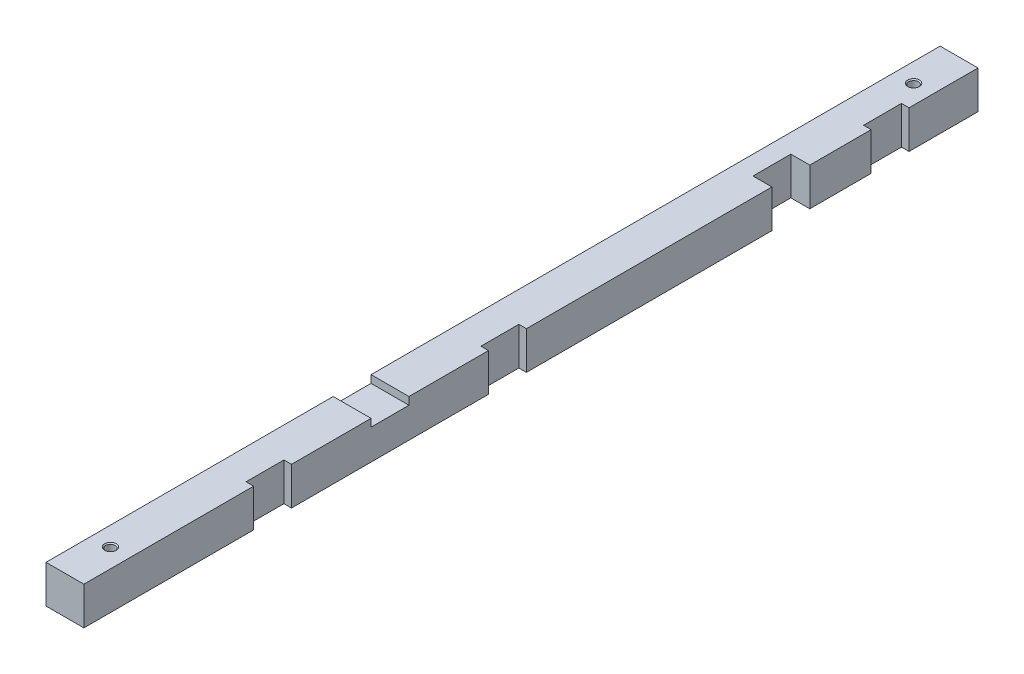
ISO-10303-21;
HEADER;
FILE_DESCRIPTION(('STEP AP214'),'2;1');
FILE_NAME('part.step','',(''),(''),'','','');
FILE_SCHEMA(('AUTOMOTIVE_DESIGN { 1 0 10303 214 1 1 1 1 }'));
ENDSEC;
DATA;
#1=APPLICATION_CONTEXT('core data for automotive mechanical design processes');
#2=APPLICATION_PROTOCOL_DEFINITION('international standard','automotive_design',2000,#1);
#3=PRODUCT_CONTEXT('',#1,'mechanical');
#4=PRODUCT('Part','Part','',(#3));
#5=PRODUCT_RELATED_PRODUCT_CATEGORY('part','',(#4));
#6=PRODUCT_DEFINITION_FORMATION('','',#4);
#7=PRODUCT_DEFINITION_CONTEXT('part definition',#1,'design');
#8=PRODUCT_DEFINITION('design','',#6,#7);
#9=PRODUCT_DEFINITION_SHAPE('','',#8);
#10=(LENGTH_UNIT() NAMED_UNIT(*) SI_UNIT(.MILLI.,.METRE.));
#11=(NAMED_UNIT(*) PLANE_ANGLE_UNIT() SI_UNIT($,.RADIAN.));
#12=(NAMED_UNIT(*) SI_UNIT($,.STERADIAN.) SOLID_ANGLE_UNIT());
#13=UNCERTAINTY_MEASURE_WITH_UNIT(LENGTH_MEASURE(1.E-05),#10,'distance_accuracy_value','');
#14=(GEOMETRIC_REPRESENTATION_CONTEXT(3) GLOBAL_UNCERTAINTY_ASSIGNED_CONTEXT((#13)) GLOBAL_UNIT_ASSIGNED_CONTEXT((#10,
#11,#12)) REPRESENTATION_CONTEXT('',''));
#15=CARTESIAN_POINT('',(0.,0.,0.));
#16=DIRECTION('',(0.,0.,1.));
#17=DIRECTION('',(1.,0.,0.));
#18=AXIS2_PLACEMENT_3D('',#15,#16,#17);
#19=CARTESIAN_POINT('',(-5.,5.,-2.));
#20=DIRECTION('',(0.,1.,0.));
#21=DIRECTION('',(0.,0.,1.));
#22=AXIS2_PLACEMENT_3D('',#19,#20,#21);
#23=PLANE('',#22);
#24=CARTESIAN_POINT('',(0.,5.,10.));
#25=DIRECTION('',(0.,1.,0.));
#26=DIRECTION('',(0.,0.,1.));
#27=AXIS2_PLACEMENT_3D('',#24,#25,#26);
#28=CIRCLE('',#27,1.525);
#29=CARTESIAN_POINT('',(0.,5.,11.525));
#30=VERTEX_POINT('',#29);
#31=EDGE_CURVE('E496',#30,#30,#28,.T.);
#32=ORIENTED_EDGE('',*,*,#31,.F.);
#33=EDGE_LOOP('',(#32));
#34=FACE_BOUND('',#33,.T.);
#35=DIRECTION('',(-1.,0.,0.));
#36=VECTOR('',#35,1.);
#37=CARTESIAN_POINT('',(5.,5.,148.2));
#38=LINE('',#37,#36);
#39=CARTESIAN_POINT('',(5.,5.,148.2));
#40=VERTEX_POINT('',#39);
#41=CARTESIAN_POINT('',(-5.,5.,148.2));
#42=VERTEX_POINT('',#41);
#43=EDGE_CURVE('E234',#40,#42,#38,.T.);
#44=ORIENTED_EDGE('',*,*,#43,.F.);
#45=DIRECTION('',(0.,0.,1.));
#46=VECTOR('',#45,1.);
#47=CARTESIAN_POINT('',(5.,5.,-2.));
#48=LINE('',#47,#46);
#49=CARTESIAN_POINT('',(5.,5.,127.2));
#50=VERTEX_POINT('',#49);
#51=EDGE_CURVE('E223',#50,#40,#48,.T.);
#52=ORIENTED_EDGE('',*,*,#51,.F.);
#53=DIRECTION('',(1.,0.,0.));
#54=VECTOR('',#53,1.);
#55=CARTESIAN_POINT('',(5.,5.,127.2));
#56=LINE('',#55,#54);
#57=CARTESIAN_POINT('',(3.,5.,127.2));
#58=VERTEX_POINT('',#57);
#59=EDGE_CURVE('E321',#58,#50,#56,.T.);
#60=ORIENTED_EDGE('',*,*,#59,.F.);
#61=DIRECTION('',(0.,0.,1.));
#62=VECTOR('',#61,1.);
#63=CARTESIAN_POINT('',(3.,5.,117.2));
#64=LINE('',#63,#62);
#65=CARTESIAN_POINT('',(3.,5.,117.2));
#66=VERTEX_POINT('',#65);
#67=EDGE_CURVE('E330',#66,#58,#64,.T.);
#68=ORIENTED_EDGE('',*,*,#67,.F.);
#69=DIRECTION('',(-1.,0.,0.));
#70=VECTOR('',#69,1.);
#71=CARTESIAN_POINT('',(5.,5.,117.2));
#72=LINE('',#71,#70);
#73=CARTESIAN_POINT('',(5.,5.,117.2));
#74=VERTEX_POINT('',#73);
#75=EDGE_CURVE('E310',#74,#66,#72,.T.);
#76=ORIENTED_EDGE('',*,*,#75,.F.);
#77=CARTESIAN_POINT('',(5.,5.,52.3999999999999));
#78=VERTEX_POINT('',#77);
#79=EDGE_CURVE('E436',#78,#74,#48,.T.);
#80=ORIENTED_EDGE('',*,*,#79,.F.);
#81=DIRECTION('',(1.,0.,0.));
#82=VECTOR('',#81,1.);
#83=CARTESIAN_POINT('',(5.,5.,52.3999999999999));
#84=LINE('',#83,#82);
#85=CARTESIAN_POINT('',(0.,5.,52.3999999999999));
#86=VERTEX_POINT('',#85);
#87=EDGE_CURVE('E243',#86,#78,#84,.T.);
#88=ORIENTED_EDGE('',*,*,#87,.F.);
#89=DIRECTION('',(0.,0.,1.));
#90=VECTOR('',#89,1.);
#91=CARTESIAN_POINT('',(0.,5.,52.3999999999999));
#92=LINE('',#91,#90);
#93=CARTESIAN_POINT('',(0.,5.,42.3999999999999));
#94=VERTEX_POINT('',#93);
#95=EDGE_CURVE('E251',#94,#86,#92,.T.);
#96=ORIENTED_EDGE('',*,*,#95,.F.);
#97=DIRECTION('',(-1.,0.,0.));
#98=VECTOR('',#97,1.);
#99=CARTESIAN_POINT('',(5.,5.,42.3999999999999));
#100=LINE('',#99,#98);
#101=CARTESIAN_POINT('',(5.,5.,42.3999999999999));
#102=VERTEX_POINT('',#101);
#103=EDGE_CURVE('E236',#102,#94,#100,.T.);
#104=ORIENTED_EDGE('',*,*,#103,.F.);
#105=CARTESIAN_POINT('',(5.,5.,26.2));
#106=VERTEX_POINT('',#105);
#107=EDGE_CURVE('E368',#106,#102,#48,.T.);
#108=ORIENTED_EDGE('',*,*,#107,.F.);
#109=DIRECTION('',(1.,0.,0.));
#110=VECTOR('',#109,1.);
#111=CARTESIAN_POINT('',(5.,5.,26.2));
#112=LINE('',#111,#110);
#113=CARTESIAN_POINT('',(2.99999999999998,5.,26.2));
#114=VERTEX_POINT('',#113);
#115=EDGE_CURVE('E268',#114,#106,#112,.T.);
#116=ORIENTED_EDGE('',*,*,#115,.F.);
#117=DIRECTION('',(0.,0.,1.));
#118=VECTOR('',#117,1.);
#119=CARTESIAN_POINT('',(2.99999999999998,5.,16.2));
#120=LINE('',#119,#118);
#121=CARTESIAN_POINT('',(2.99999999999998,5.,16.2));
#122=VERTEX_POINT('',#121);
#123=EDGE_CURVE('E277',#122,#114,#120,.T.);
#124=ORIENTED_EDGE('',*,*,#123,.F.);
#125=DIRECTION('',(-1.,0.,0.));
#126=VECTOR('',#125,1.);
#127=CARTESIAN_POINT('',(5.,5.,16.2));
#128=LINE('',#127,#126);
#129=CARTESIAN_POINT('',(5.,5.,16.2));
#130=VERTEX_POINT('',#129);
#131=EDGE_CURVE('E258',#130,#122,#128,.T.);
#132=ORIENTED_EDGE('',*,*,#131,.F.);
#133=CARTESIAN_POINT('',(5.,5.,-2.));
#134=VERTEX_POINT('',#133);
#135=EDGE_CURVE('E366',#134,#130,#48,.T.);
#136=ORIENTED_EDGE('',*,*,#135,.F.);
#137=DIRECTION('',(-1.,0.,0.));
#138=VECTOR('',#137,1.);
#139=CARTESIAN_POINT('',(-5.,5.,-2.));
#140=LINE('',#139,#138);
#141=CARTESIAN_POINT('',(-5.,5.,-2.));
#142=VERTEX_POINT('',#141);
#143=EDGE_CURVE('E363',#134,#142,#140,.T.);
#144=ORIENTED_EDGE('',*,*,#143,.T.);
#145=DIRECTION('',(0.,0.,1.));
#146=VECTOR('',#145,1.);
#147=CARTESIAN_POINT('',(-5.,5.,-2.));
#148=LINE('',#147,#146);
#149=EDGE_CURVE('E12',#142,#42,#148,.T.);
#150=ORIENTED_EDGE('',*,*,#149,.T.);
#151=EDGE_LOOP('',(#44,#52,#60,#68,#76,#80,#88,#96,#104,#108,#116,#124,#132,#136,#144,#150));
#152=FACE_BOUND('',#151,.T.);
#153=ADVANCED_FACE('F36',(#34,#152),#23,.T.);
#154=CARTESIAN_POINT('',(5.,5.,-2.));
#155=DIRECTION('',(1.,0.,0.));
#156=DIRECTION('',(0.,1.,0.));
#157=AXIS2_PLACEMENT_3D('',#154,#155,#156);
#158=PLANE('',#157);
#159=DIRECTION('',(0.,1.,0.));
#160=VECTOR('',#159,1.);
#161=CARTESIAN_POINT('',(5.,-5.,52.3999999999999));
#162=LINE('',#161,#160);
#163=CARTESIAN_POINT('',(5.,-5.,52.3999999999999));
#164=VERTEX_POINT('',#163);
#165=EDGE_CURVE('E255',#164,#78,#162,.T.);
#166=ORIENTED_EDGE('',*,*,#165,.T.);
#167=ORIENTED_EDGE('',*,*,#79,.T.);
#168=DIRECTION('',(0.,1.,0.));
#169=VECTOR('',#168,1.);
#170=CARTESIAN_POINT('',(5.,-5.,117.2));
#171=LINE('',#170,#169);
#172=CARTESIAN_POINT('',(5.,-5.,117.2));
#173=VERTEX_POINT('',#172);
#174=EDGE_CURVE('E327',#173,#74,#171,.T.);
#175=ORIENTED_EDGE('',*,*,#174,.F.);
#176=DIRECTION('',(0.,0.,1.));
#177=VECTOR('',#176,1.);
#178=CARTESIAN_POINT('',(5.,-5.,-2.));
#179=LINE('',#178,#177);
#180=EDGE_CURVE('E374',#164,#173,#179,.T.);
#181=ORIENTED_EDGE('',*,*,#180,.F.);
#182=EDGE_LOOP('',(#166,#167,#175,#181));
#183=FACE_BOUND('',#182,.T.);
#184=ADVANCED_FACE('F435',(#183),#158,.T.);
#185=DIRECTION('',(0.,1.,0.));
#186=VECTOR('',#185,1.);
#187=CARTESIAN_POINT('',(5.,-5.,42.3999999999999));
#188=LINE('',#187,#186);
#189=CARTESIAN_POINT('',(5.,-5.,42.3999999999999));
#190=VERTEX_POINT('',#189);
#191=EDGE_CURVE('E248',#190,#102,#188,.T.);
#192=ORIENTED_EDGE('',*,*,#191,.F.);
#193=CARTESIAN_POINT('',(5.,-5.,26.2));
#194=VERTEX_POINT('',#193);
#195=EDGE_CURVE('E373',#194,#190,#179,.T.);
#196=ORIENTED_EDGE('',*,*,#195,.F.);
#197=DIRECTION('',(0.,1.,0.));
#198=VECTOR('',#197,1.);
#199=CARTESIAN_POINT('',(5.,-5.,26.2));
#200=LINE('',#199,#198);
#201=EDGE_CURVE('E281',#194,#106,#200,.T.);
#202=ORIENTED_EDGE('',*,*,#201,.T.);
#203=ORIENTED_EDGE('',*,*,#107,.T.);
#204=EDGE_LOOP('',(#192,#196,#202,#203));
#205=FACE_BOUND('',#204,.T.);
#206=ADVANCED_FACE('F420',(#205),#158,.T.);
#207=DIRECTION('',(0.,1.,0.));
#208=VECTOR('',#207,1.);
#209=CARTESIAN_POINT('',(5.,-5.,189.2));
#210=LINE('',#209,#208);
#211=CARTESIAN_POINT('',(5.,-5.,189.2));
#212=VERTEX_POINT('',#211);
#213=CARTESIAN_POINT('',(5.,5.,189.2));
#214=VERTEX_POINT('',#213);
#215=EDGE_CURVE('E307',#212,#214,#210,.T.);
#216=ORIENTED_EDGE('',*,*,#215,.T.);
#217=CARTESIAN_POINT('',(5.,5.,234.));
#218=VERTEX_POINT('',#217);
#219=EDGE_CURVE('E372',#214,#218,#48,.T.);
#220=ORIENTED_EDGE('',*,*,#219,.T.);
#221=DIRECTION('',(0.,1.,0.));
#222=VECTOR('',#221,1.);
#223=CARTESIAN_POINT('',(5.,5.,234.));
#224=LINE('',#223,#222);
#225=CARTESIAN_POINT('',(5.,-5.,234.));
#226=VERTEX_POINT('',#225);
#227=EDGE_CURVE('E343',#226,#218,#224,.T.);
#228=ORIENTED_EDGE('',*,*,#227,.F.);
#229=EDGE_CURVE('E378',#212,#226,#179,.T.);
#230=ORIENTED_EDGE('',*,*,#229,.F.);
#231=EDGE_LOOP('',(#216,#220,#228,#230));
#232=FACE_BOUND('',#231,.T.);
#233=ADVANCED_FACE('F458',(#232),#158,.T.);
#234=DIRECTION('',(0.,-1.,0.));
#235=VECTOR('',#234,1.);
#236=CARTESIAN_POINT('',(5.,5.,148.2));
#237=LINE('',#236,#235);
#238=CARTESIAN_POINT('',(5.,3.,148.2));
#239=VERTEX_POINT('',#238);
#240=EDGE_CURVE('E202',#40,#239,#237,.T.);
#241=ORIENTED_EDGE('',*,*,#240,.T.);
#242=DIRECTION('',(0.,0.,1.));
#243=VECTOR('',#242,1.);
#244=CARTESIAN_POINT('',(5.,3.,148.2));
#245=LINE('',#244,#243);
#246=CARTESIAN_POINT('',(5.,3.,158.2));
#247=VERTEX_POINT('',#246);
#248=EDGE_CURVE('E213',#239,#247,#245,.T.);
#249=ORIENTED_EDGE('',*,*,#248,.T.);
#250=DIRECTION('',(0.,1.,0.));
#251=VECTOR('',#250,1.);
#252=CARTESIAN_POINT('',(5.,5.,158.2));
#253=LINE('',#252,#251);
#254=CARTESIAN_POINT('',(5.,5.,158.2));
#255=VERTEX_POINT('',#254);
#256=EDGE_CURVE('E210',#247,#255,#253,.T.);
#257=ORIENTED_EDGE('',*,*,#256,.T.);
#258=CARTESIAN_POINT('',(5.,5.,179.2));
#259=VERTEX_POINT('',#258);
#260=EDGE_CURVE('E369',#255,#259,#48,.T.);
#261=ORIENTED_EDGE('',*,*,#260,.T.);
#262=DIRECTION('',(0.,1.,0.));
#263=VECTOR('',#262,1.);
#264=CARTESIAN_POINT('',(5.,-5.,179.2));
#265=LINE('',#264,#263);
#266=CARTESIAN_POINT('',(5.,-5.,179.2));
#267=VERTEX_POINT('',#266);
#268=EDGE_CURVE('E300',#267,#259,#265,.T.);
#269=ORIENTED_EDGE('',*,*,#268,.F.);
#270=CARTESIAN_POINT('',(5.,-5.,127.2));
#271=VERTEX_POINT('',#270);
#272=EDGE_CURVE('E375',#271,#267,#179,.T.);
#273=ORIENTED_EDGE('',*,*,#272,.F.);
#274=DIRECTION('',(0.,1.,0.));
#275=VECTOR('',#274,1.);
#276=CARTESIAN_POINT('',(5.,-5.,127.2));
#277=LINE('',#276,#275);
#278=EDGE_CURVE('E334',#271,#50,#277,.T.);
#279=ORIENTED_EDGE('',*,*,#278,.T.);
#280=ORIENTED_EDGE('',*,*,#51,.T.);
#281=EDGE_LOOP('',(#241,#249,#257,#261,#269,#273,#279,#280));
#282=FACE_BOUND('',#281,.T.);
#283=ADVANCED_FACE('F220',(#282),#158,.T.);
#284=CARTESIAN_POINT('',(-5.,5.,-2.));
#285=DIRECTION('',(-1.,0.,0.));
#286=DIRECTION('',(0.,-1.,0.));
#287=AXIS2_PLACEMENT_3D('',#284,#285,#286);
#288=PLANE('',#287);
#289=DIRECTION('',(0.,-1.,0.));
#290=VECTOR('',#289,1.);
#291=CARTESIAN_POINT('',(-5.,5.,148.2));
#292=LINE('',#291,#290);
#293=CARTESIAN_POINT('',(-5.,3.,148.2));
#294=VERTEX_POINT('',#293);
#295=EDGE_CURVE('E205',#42,#294,#292,.T.);
#296=ORIENTED_EDGE('',*,*,#295,.F.);
#297=ORIENTED_EDGE('',*,*,#149,.F.);
#298=DIRECTION('',(0.,-1.,0.));
#299=VECTOR('',#298,1.);
#300=CARTESIAN_POINT('',(-5.,5.,-2.));
#301=LINE('',#300,#299);
#302=CARTESIAN_POINT('',(-5.,-5.,-2.));
#303=VERTEX_POINT('',#302);
#304=EDGE_CURVE('E346',#142,#303,#301,.T.);
#305=ORIENTED_EDGE('',*,*,#304,.T.);
#306=DIRECTION('',(0.,0.,1.));
#307=VECTOR('',#306,1.);
#308=CARTESIAN_POINT('',(-5.,-5.,-2.));
#309=LINE('',#308,#307);
#310=CARTESIAN_POINT('',(-5.,-5.,234.));
#311=VERTEX_POINT('',#310);
#312=EDGE_CURVE('E40',#303,#311,#309,.T.);
#313=ORIENTED_EDGE('',*,*,#312,.T.);
#314=DIRECTION('',(0.,-1.,0.));
#315=VECTOR('',#314,1.);
#316=CARTESIAN_POINT('',(-5.,5.,234.));
#317=LINE('',#316,#315);
#318=CARTESIAN_POINT('',(-5.,5.,234.));
#319=VERTEX_POINT('',#318);
#320=EDGE_CURVE('E350',#319,#311,#317,.T.);
#321=ORIENTED_EDGE('',*,*,#320,.F.);
#322=CARTESIAN_POINT('',(-5.,5.,158.2));
#323=VERTEX_POINT('',#322);
#324=EDGE_CURVE('E45',#323,#319,#148,.T.);
#325=ORIENTED_EDGE('',*,*,#324,.F.);
#326=DIRECTION('',(0.,1.,0.));
#327=VECTOR('',#326,1.);
#328=CARTESIAN_POINT('',(-5.,5.,158.2));
#329=LINE('',#328,#327);
#330=CARTESIAN_POINT('',(-5.,3.,158.2));
#331=VERTEX_POINT('',#330);
#332=EDGE_CURVE('E53',#331,#323,#329,.T.);
#333=ORIENTED_EDGE('',*,*,#332,.F.);
#334=DIRECTION('',(0.,0.,1.));
#335=VECTOR('',#334,1.);
#336=CARTESIAN_POINT('',(-5.,3.,148.2));
#337=LINE('',#336,#335);
#338=EDGE_CURVE('E225',#294,#331,#337,.T.);
#339=ORIENTED_EDGE('',*,*,#338,.F.);
#340=EDGE_LOOP('',(#296,#297,#305,#313,#321,#325,#333,#339));
#341=FACE_BOUND('',#340,.T.);
#342=ADVANCED_FACE('F38',(#341),#288,.T.);
#343=CARTESIAN_POINT('',(0.,5.,222.));
#344=DIRECTION('',(0.,1.,0.));
#345=DIRECTION('',(0.,0.,1.));
#346=AXIS2_PLACEMENT_3D('',#343,#344,#345);
#347=CIRCLE('',#346,1.525);
#348=CARTESIAN_POINT('',(0.,5.,223.525));
#349=VERTEX_POINT('',#348);
#350=EDGE_CURVE('E486',#349,#349,#347,.T.);
#351=ORIENTED_EDGE('',*,*,#350,.F.);
#352=EDGE_LOOP('',(#351));
#353=FACE_BOUND('',#352,.T.);
#354=DIRECTION('',(-1.,0.,0.));
#355=VECTOR('',#354,1.);
#356=CARTESIAN_POINT('',(5.,5.,158.2));
#357=LINE('',#356,#355);
#358=EDGE_CURVE('E237',#255,#323,#357,.T.);
#359=ORIENTED_EDGE('',*,*,#358,.T.);
#360=ORIENTED_EDGE('',*,*,#324,.T.);
#361=DIRECTION('',(-1.,0.,0.));
#362=VECTOR('',#361,1.);
#363=CARTESIAN_POINT('',(-5.,5.,234.));
#364=LINE('',#363,#362);
#365=EDGE_CURVE('E336',#218,#319,#364,.T.);
#366=ORIENTED_EDGE('',*,*,#365,.F.);
#367=ORIENTED_EDGE('',*,*,#219,.F.);
#368=DIRECTION('',(1.,0.,0.));
#369=VECTOR('',#368,1.);
#370=CARTESIAN_POINT('',(5.,5.,189.2));
#371=LINE('',#370,#369);
#372=CARTESIAN_POINT('',(3.,5.,189.2));
#373=VERTEX_POINT('',#372);
#374=EDGE_CURVE('E294',#373,#214,#371,.T.);
#375=ORIENTED_EDGE('',*,*,#374,.F.);
#376=DIRECTION('',(0.,0.,1.));
#377=VECTOR('',#376,1.);
#378=CARTESIAN_POINT('',(3.00000000000002,5.,179.2));
#379=LINE('',#378,#377);
#380=CARTESIAN_POINT('',(3.00000000000002,5.,179.2));
#381=VERTEX_POINT('',#380);
#382=EDGE_CURVE('E303',#381,#373,#379,.T.);
#383=ORIENTED_EDGE('',*,*,#382,.F.);
#384=DIRECTION('',(-1.,0.,0.));
#385=VECTOR('',#384,1.);
#386=CARTESIAN_POINT('',(5.,5.,179.2));
#387=LINE('',#386,#385);
#388=EDGE_CURVE('E284',#259,#381,#387,.T.);
#389=ORIENTED_EDGE('',*,*,#388,.F.);
#390=ORIENTED_EDGE('',*,*,#260,.F.);
#391=EDGE_LOOP('',(#359,#360,#366,#367,#375,#383,#389,#390));
#392=FACE_BOUND('',#391,.T.);
#393=ADVANCED_FACE('F395',(#353,#392),#23,.T.);
#394=DIRECTION('',(0.,1.,0.));
#395=VECTOR('',#394,1.);
#396=CARTESIAN_POINT('',(5.,-5.,16.2));
#397=LINE('',#396,#395);
#398=CARTESIAN_POINT('',(5.,-5.,16.2));
#399=VERTEX_POINT('',#398);
#400=EDGE_CURVE('E274',#399,#130,#397,.T.);
#401=ORIENTED_EDGE('',*,*,#400,.F.);
#402=CARTESIAN_POINT('',(5.,-5.,-2.));
#403=VERTEX_POINT('',#402);
#404=EDGE_CURVE('E370',#403,#399,#179,.T.);
#405=ORIENTED_EDGE('',*,*,#404,.F.);
#406=DIRECTION('',(0.,1.,0.));
#407=VECTOR('',#406,1.);
#408=CARTESIAN_POINT('',(5.,5.,-2.));
#409=LINE('',#408,#407);
#410=EDGE_CURVE('E360',#403,#134,#409,.T.);
#411=ORIENTED_EDGE('',*,*,#410,.T.);
#412=ORIENTED_EDGE('',*,*,#135,.T.);
#413=EDGE_LOOP('',(#401,#405,#411,#412));
#414=FACE_BOUND('',#413,.T.);
#415=ADVANCED_FACE('F406',(#414),#158,.T.);
#416=CARTESIAN_POINT('',(-5.,-5.,-2.));
#417=DIRECTION('',(0.,-1.,0.));
#418=DIRECTION('',(0.,0.,-1.));
#419=AXIS2_PLACEMENT_3D('',#416,#417,#418);
#420=PLANE('',#419);
#421=CARTESIAN_POINT('',(0.,-5.,222.));
#422=DIRECTION('',(0.,1.,0.));
#423=DIRECTION('',(0.,0.,1.));
#424=AXIS2_PLACEMENT_3D('',#421,#422,#423);
#425=CIRCLE('',#424,1.25);
#426=CARTESIAN_POINT('',(0.,-5.,223.25));
#427=VERTEX_POINT('',#426);
#428=EDGE_CURVE('E491',#427,#427,#425,.T.);
#429=ORIENTED_EDGE('',*,*,#428,.T.);
#430=EDGE_LOOP('',(#429));
#431=FACE_BOUND('',#430,.T.);
#432=CARTESIAN_POINT('',(0.,-5.,10.));
#433=DIRECTION('',(0.,1.,0.));
#434=DIRECTION('',(0.,0.,1.));
#435=AXIS2_PLACEMENT_3D('',#432,#433,#434);
#436=CIRCLE('',#435,1.25);
#437=CARTESIAN_POINT('',(0.,-5.,11.25));
#438=VERTEX_POINT('',#437);
#439=EDGE_CURVE('E228',#438,#438,#436,.T.);
#440=ORIENTED_EDGE('',*,*,#439,.T.);
#441=EDGE_LOOP('',(#440));
#442=FACE_BOUND('',#441,.T.);
#443=DIRECTION('',(1.,0.,0.));
#444=VECTOR('',#443,1.);
#445=CARTESIAN_POINT('',(5.,-5.,52.3999999999999));
#446=LINE('',#445,#444);
#447=CARTESIAN_POINT('',(0.,-5.,52.3999999999999));
#448=VERTEX_POINT('',#447);
#449=EDGE_CURVE('E245',#448,#164,#446,.T.);
#450=ORIENTED_EDGE('',*,*,#449,.T.);
#451=ORIENTED_EDGE('',*,*,#180,.T.);
#452=DIRECTION('',(-1.,0.,0.));
#453=VECTOR('',#452,1.);
#454=CARTESIAN_POINT('',(5.,-5.,117.2));
#455=LINE('',#454,#453);
#456=CARTESIAN_POINT('',(3.,-5.,117.2));
#457=VERTEX_POINT('',#456);
#458=EDGE_CURVE('E317',#173,#457,#455,.T.);
#459=ORIENTED_EDGE('',*,*,#458,.T.);
#460=DIRECTION('',(0.,0.,1.));
#461=VECTOR('',#460,1.);
#462=CARTESIAN_POINT('',(3.,-5.,117.2));
#463=LINE('',#462,#461);
#464=CARTESIAN_POINT('',(3.,-5.,127.2));
#465=VERTEX_POINT('',#464);
#466=EDGE_CURVE('E320',#457,#465,#463,.T.);
#467=ORIENTED_EDGE('',*,*,#466,.T.);
#468=DIRECTION('',(1.,0.,0.));
#469=VECTOR('',#468,1.);
#470=CARTESIAN_POINT('',(5.,-5.,127.2));
#471=LINE('',#470,#469);
#472=EDGE_CURVE('E324',#465,#271,#471,.T.);
#473=ORIENTED_EDGE('',*,*,#472,.T.);
#474=ORIENTED_EDGE('',*,*,#272,.T.);
#475=DIRECTION('',(-1.,0.,0.));
#476=VECTOR('',#475,1.);
#477=CARTESIAN_POINT('',(5.,-5.,179.2));
#478=LINE('',#477,#476);
#479=CARTESIAN_POINT('',(3.00000000000002,-5.,179.2));
#480=VERTEX_POINT('',#479);
#481=EDGE_CURVE('E290',#267,#480,#478,.T.);
#482=ORIENTED_EDGE('',*,*,#481,.T.);
#483=DIRECTION('',(0.,0.,1.));
#484=VECTOR('',#483,1.);
#485=CARTESIAN_POINT('',(3.00000000000002,-5.,179.2));
#486=LINE('',#485,#484);
#487=CARTESIAN_POINT('',(3.,-5.,189.2));
#488=VERTEX_POINT('',#487);
#489=EDGE_CURVE('E293',#480,#488,#486,.T.);
#490=ORIENTED_EDGE('',*,*,#489,.T.);
#491=DIRECTION('',(1.,0.,0.));
#492=VECTOR('',#491,1.);
#493=CARTESIAN_POINT('',(5.,-5.,189.2));
#494=LINE('',#493,#492);
#495=EDGE_CURVE('E297',#488,#212,#494,.T.);
#496=ORIENTED_EDGE('',*,*,#495,.T.);
#497=ORIENTED_EDGE('',*,*,#229,.T.);
#498=DIRECTION('',(1.,0.,0.));
#499=VECTOR('',#498,1.);
#500=CARTESIAN_POINT('',(-5.,-5.,234.));
#501=LINE('',#500,#499);
#502=EDGE_CURVE('E347',#311,#226,#501,.T.);
#503=ORIENTED_EDGE('',*,*,#502,.F.);
#504=ORIENTED_EDGE('',*,*,#312,.F.);
#505=DIRECTION('',(1.,0.,0.));
#506=VECTOR('',#505,1.);
#507=CARTESIAN_POINT('',(-5.,-5.,-2.));
#508=LINE('',#507,#506);
#509=EDGE_CURVE('E357',#303,#403,#508,.T.);
#510=ORIENTED_EDGE('',*,*,#509,.T.);
#511=ORIENTED_EDGE('',*,*,#404,.T.);
#512=DIRECTION('',(-1.,0.,0.));
#513=VECTOR('',#512,1.);
#514=CARTESIAN_POINT('',(5.,-5.,16.2));
#515=LINE('',#514,#513);
#516=CARTESIAN_POINT('',(2.99999999999998,-5.,16.2));
#517=VERTEX_POINT('',#516);
#518=EDGE_CURVE('E264',#399,#517,#515,.T.);
#519=ORIENTED_EDGE('',*,*,#518,.T.);
#520=DIRECTION('',(0.,0.,1.));
#521=VECTOR('',#520,1.);
#522=CARTESIAN_POINT('',(2.99999999999998,-5.,16.2));
#523=LINE('',#522,#521);
#524=CARTESIAN_POINT('',(2.99999999999998,-5.,26.2));
#525=VERTEX_POINT('',#524);
#526=EDGE_CURVE('E267',#517,#525,#523,.T.);
#527=ORIENTED_EDGE('',*,*,#526,.T.);
#528=DIRECTION('',(1.,0.,0.));
#529=VECTOR('',#528,1.);
#530=CARTESIAN_POINT('',(5.,-5.,26.2));
#531=LINE('',#530,#529);
#532=EDGE_CURVE('E271',#525,#194,#531,.T.);
#533=ORIENTED_EDGE('',*,*,#532,.T.);
#534=ORIENTED_EDGE('',*,*,#195,.T.);
#535=DIRECTION('',(-1.,0.,0.));
#536=VECTOR('',#535,1.);
#537=CARTESIAN_POINT('',(5.,-5.,42.3999999999999));
#538=LINE('',#537,#536);
#539=CARTESIAN_POINT('',(0.,-5.,42.3999999999999));
#540=VERTEX_POINT('',#539);
#541=EDGE_CURVE('E240',#190,#540,#538,.T.);
#542=ORIENTED_EDGE('',*,*,#541,.T.);
#543=DIRECTION('',(0.,0.,1.));
#544=VECTOR('',#543,1.);
#545=CARTESIAN_POINT('',(0.,-5.,52.3999999999999));
#546=LINE('',#545,#544);
#547=EDGE_CURVE('E61',#540,#448,#546,.T.);
#548=ORIENTED_EDGE('',*,*,#547,.T.);
#549=EDGE_LOOP('',(#450,#451,#459,#467,#473,#474,#482,#490,#496,#497,#503,#504,#510,#511,#519,
#527,#533,#534,#542,#548));
#550=FACE_BOUND('',#549,.T.);
#551=ADVANCED_FACE('F389',(#431,#442,#550),#420,.T.);
#552=CARTESIAN_POINT('',(0.,0.,-2.));
#553=DIRECTION('',(0.,0.,1.));
#554=DIRECTION('',(1.,0.,0.));
#555=AXIS2_PLACEMENT_3D('',#552,#553,#554);
#556=PLANE('',#555);
#557=ORIENTED_EDGE('',*,*,#304,.F.);
#558=ORIENTED_EDGE('',*,*,#143,.F.);
#559=ORIENTED_EDGE('',*,*,#410,.F.);
#560=ORIENTED_EDGE('',*,*,#509,.F.);
#561=EDGE_LOOP('',(#557,#558,#559,#560));
#562=FACE_BOUND('',#561,.T.);
#563=ADVANCED_FACE('F403',(#562),#556,.F.);
#564=CARTESIAN_POINT('',(-5.00000000000001,188.142135623731,234.));
#565=DIRECTION('',(0.,0.,1.));
#566=DIRECTION('',(0.,-1.,0.));
#567=AXIS2_PLACEMENT_3D('',#564,#565,#566);
#568=PLANE('',#567);
#569=ORIENTED_EDGE('',*,*,#365,.T.);
#570=ORIENTED_EDGE('',*,*,#320,.T.);
#571=ORIENTED_EDGE('',*,*,#502,.T.);
#572=ORIENTED_EDGE('',*,*,#227,.T.);
#573=EDGE_LOOP('',(#569,#570,#571,#572));
#574=FACE_BOUND('',#573,.T.);
#575=ADVANCED_FACE('F391',(#574),#568,.T.);
#576=CARTESIAN_POINT('',(5.,-5.,127.2));
#577=DIRECTION('',(0.,0.,1.));
#578=DIRECTION('',(1.,0.,0.));
#579=AXIS2_PLACEMENT_3D('',#576,#577,#578);
#580=PLANE('',#579);
#581=ORIENTED_EDGE('',*,*,#59,.T.);
#582=ORIENTED_EDGE('',*,*,#278,.F.);
#583=ORIENTED_EDGE('',*,*,#472,.F.);
#584=DIRECTION('',(0.,1.,0.));
#585=VECTOR('',#584,1.);
#586=CARTESIAN_POINT('',(3.,-5.,127.2));
#587=LINE('',#586,#585);
#588=EDGE_CURVE('E337',#465,#58,#587,.T.);
#589=ORIENTED_EDGE('',*,*,#588,.T.);
#590=EDGE_LOOP('',(#581,#582,#583,#589));
#591=FACE_BOUND('',#590,.T.);
#592=ADVANCED_FACE('F635',(#591),#580,.F.);
#593=CARTESIAN_POINT('',(3.,-5.,117.2));
#594=DIRECTION('',(-1.,0.,0.));
#595=DIRECTION('',(0.,0.,1.));
#596=AXIS2_PLACEMENT_3D('',#593,#594,#595);
#597=PLANE('',#596);
#598=ORIENTED_EDGE('',*,*,#67,.T.);
#599=ORIENTED_EDGE('',*,*,#588,.F.);
#600=ORIENTED_EDGE('',*,*,#466,.F.);
#601=DIRECTION('',(0.,1.,0.));
#602=VECTOR('',#601,1.);
#603=CARTESIAN_POINT('',(3.,-5.,117.2));
#604=LINE('',#603,#602);
#605=EDGE_CURVE('E339',#457,#66,#604,.T.);
#606=ORIENTED_EDGE('',*,*,#605,.T.);
#607=EDGE_LOOP('',(#598,#599,#600,#606));
#608=FACE_BOUND('',#607,.T.);
#609=ADVANCED_FACE('F444',(#608),#597,.F.);
#610=CARTESIAN_POINT('',(5.,-5.,117.2));
#611=DIRECTION('',(0.,0.,-1.));
#612=DIRECTION('',(-1.,0.,0.));
#613=AXIS2_PLACEMENT_3D('',#610,#611,#612);
#614=PLANE('',#613);
#615=ORIENTED_EDGE('',*,*,#75,.T.);
#616=ORIENTED_EDGE('',*,*,#605,.F.);
#617=ORIENTED_EDGE('',*,*,#458,.F.);
#618=ORIENTED_EDGE('',*,*,#174,.T.);
#619=EDGE_LOOP('',(#615,#616,#617,#618));
#620=FACE_BOUND('',#619,.T.);
#621=ADVANCED_FACE('F439',(#620),#614,.F.);
#622=CARTESIAN_POINT('',(5.,-5.,189.2));
#623=DIRECTION('',(0.,0.,1.));
#624=DIRECTION('',(1.,0.,0.));
#625=AXIS2_PLACEMENT_3D('',#622,#623,#624);
#626=PLANE('',#625);
#627=ORIENTED_EDGE('',*,*,#374,.T.);
#628=ORIENTED_EDGE('',*,*,#215,.F.);
#629=ORIENTED_EDGE('',*,*,#495,.F.);
#630=DIRECTION('',(0.,1.,0.));
#631=VECTOR('',#630,1.);
#632=CARTESIAN_POINT('',(3.,-5.,189.2));
#633=LINE('',#632,#631);
#634=EDGE_CURVE('E311',#488,#373,#633,.T.);
#635=ORIENTED_EDGE('',*,*,#634,.T.);
#636=EDGE_LOOP('',(#627,#628,#629,#635));
#637=FACE_BOUND('',#636,.T.);
#638=ADVANCED_FACE('F459',(#637),#626,.F.);
#639=CARTESIAN_POINT('',(3.00000000000002,-5.,179.2));
#640=DIRECTION('',(-1.,0.,0.));
#641=DIRECTION('',(0.,0.,1.));
#642=AXIS2_PLACEMENT_3D('',#639,#640,#641);
#643=PLANE('',#642);
#644=ORIENTED_EDGE('',*,*,#382,.T.);
#645=ORIENTED_EDGE('',*,*,#634,.F.);
#646=ORIENTED_EDGE('',*,*,#489,.F.);
#647=DIRECTION('',(0.,1.,0.));
#648=VECTOR('',#647,1.);
#649=CARTESIAN_POINT('',(3.00000000000002,-5.,179.2));
#650=LINE('',#649,#648);
#651=EDGE_CURVE('E313',#480,#381,#650,.T.);
#652=ORIENTED_EDGE('',*,*,#651,.T.);
#653=EDGE_LOOP('',(#644,#645,#646,#652));
#654=FACE_BOUND('',#653,.T.);
#655=ADVANCED_FACE('F454',(#654),#643,.F.);
#656=CARTESIAN_POINT('',(5.,-5.,179.2));
#657=DIRECTION('',(0.,0.,-1.));
#658=DIRECTION('',(-1.,0.,0.));
#659=AXIS2_PLACEMENT_3D('',#656,#657,#658);
#660=PLANE('',#659);
#661=ORIENTED_EDGE('',*,*,#388,.T.);
#662=ORIENTED_EDGE('',*,*,#651,.F.);
#663=ORIENTED_EDGE('',*,*,#481,.F.);
#664=ORIENTED_EDGE('',*,*,#268,.T.);
#665=EDGE_LOOP('',(#661,#662,#663,#664));
#666=FACE_BOUND('',#665,.T.);
#667=ADVANCED_FACE('F450',(#666),#660,.F.);
#668=CARTESIAN_POINT('',(5.,-5.,26.2));
#669=DIRECTION('',(0.,0.,1.));
#670=DIRECTION('',(1.,0.,0.));
#671=AXIS2_PLACEMENT_3D('',#668,#669,#670);
#672=PLANE('',#671);
#673=ORIENTED_EDGE('',*,*,#115,.T.);
#674=ORIENTED_EDGE('',*,*,#201,.F.);
#675=ORIENTED_EDGE('',*,*,#532,.F.);
#676=DIRECTION('',(0.,1.,0.));
#677=VECTOR('',#676,1.);
#678=CARTESIAN_POINT('',(2.99999999999998,-5.,26.2));
#679=LINE('',#678,#677);
#680=EDGE_CURVE('E285',#525,#114,#679,.T.);
#681=ORIENTED_EDGE('',*,*,#680,.T.);
#682=EDGE_LOOP('',(#673,#674,#675,#681));
#683=FACE_BOUND('',#682,.T.);
#684=ADVANCED_FACE('F532',(#683),#672,.F.);
#685=CARTESIAN_POINT('',(2.99999999999998,-5.,16.2));
#686=DIRECTION('',(-1.,0.,0.));
#687=DIRECTION('',(0.,0.,1.));
#688=AXIS2_PLACEMENT_3D('',#685,#686,#687);
#689=PLANE('',#688);
#690=ORIENTED_EDGE('',*,*,#123,.T.);
#691=ORIENTED_EDGE('',*,*,#680,.F.);
#692=ORIENTED_EDGE('',*,*,#526,.F.);
#693=DIRECTION('',(0.,1.,0.));
#694=VECTOR('',#693,1.);
#695=CARTESIAN_POINT('',(2.99999999999998,-5.,16.2));
#696=LINE('',#695,#694);
#697=EDGE_CURVE('E287',#517,#122,#696,.T.);
#698=ORIENTED_EDGE('',*,*,#697,.T.);
#699=EDGE_LOOP('',(#690,#691,#692,#698));
#700=FACE_BOUND('',#699,.T.);
#701=ADVANCED_FACE('F414',(#700),#689,.F.);
#702=CARTESIAN_POINT('',(5.,-5.,16.2));
#703=DIRECTION('',(0.,0.,-1.));
#704=DIRECTION('',(-1.,0.,0.));
#705=AXIS2_PLACEMENT_3D('',#702,#703,#704);
#706=PLANE('',#705);
#707=ORIENTED_EDGE('',*,*,#131,.T.);
#708=ORIENTED_EDGE('',*,*,#697,.F.);
#709=ORIENTED_EDGE('',*,*,#518,.F.);
#710=ORIENTED_EDGE('',*,*,#400,.T.);
#711=EDGE_LOOP('',(#707,#708,#709,#710));
#712=FACE_BOUND('',#711,.T.);
#713=ADVANCED_FACE('F408',(#712),#706,.F.);
#714=CARTESIAN_POINT('',(5.,-5.,52.3999999999999));
#715=DIRECTION('',(0.,0.,1.));
#716=DIRECTION('',(1.,0.,0.));
#717=AXIS2_PLACEMENT_3D('',#714,#715,#716);
#718=PLANE('',#717);
#719=ORIENTED_EDGE('',*,*,#87,.T.);
#720=ORIENTED_EDGE('',*,*,#165,.F.);
#721=ORIENTED_EDGE('',*,*,#449,.F.);
#722=DIRECTION('',(0.,1.,0.));
#723=VECTOR('',#722,1.);
#724=CARTESIAN_POINT('',(0.,-5.,52.3999999999999));
#725=LINE('',#724,#723);
#726=EDGE_CURVE('E259',#448,#86,#725,.T.);
#727=ORIENTED_EDGE('',*,*,#726,.T.);
#728=EDGE_LOOP('',(#719,#720,#721,#727));
#729=FACE_BOUND('',#728,.T.);
#730=ADVANCED_FACE('F525',(#729),#718,.F.);
#731=CARTESIAN_POINT('',(0.,-5.,52.3999999999999));
#732=DIRECTION('',(-1.,0.,0.));
#733=DIRECTION('',(0.,0.,1.));
#734=AXIS2_PLACEMENT_3D('',#731,#732,#733);
#735=PLANE('',#734);
#736=ORIENTED_EDGE('',*,*,#95,.T.);
#737=ORIENTED_EDGE('',*,*,#726,.F.);
#738=ORIENTED_EDGE('',*,*,#547,.F.);
#739=DIRECTION('',(0.,1.,0.));
#740=VECTOR('',#739,1.);
#741=CARTESIAN_POINT('',(0.,-5.,42.3999999999999));
#742=LINE('',#741,#740);
#743=EDGE_CURVE('E261',#540,#94,#742,.T.);
#744=ORIENTED_EDGE('',*,*,#743,.T.);
#745=EDGE_LOOP('',(#736,#737,#738,#744));
#746=FACE_BOUND('',#745,.T.);
#747=ADVANCED_FACE('F428',(#746),#735,.F.);
#748=CARTESIAN_POINT('',(5.,-5.,42.3999999999999));
#749=DIRECTION('',(0.,0.,-1.));
#750=DIRECTION('',(-1.,0.,0.));
#751=AXIS2_PLACEMENT_3D('',#748,#749,#750);
#752=PLANE('',#751);
#753=ORIENTED_EDGE('',*,*,#103,.T.);
#754=ORIENTED_EDGE('',*,*,#743,.F.);
#755=ORIENTED_EDGE('',*,*,#541,.F.);
#756=ORIENTED_EDGE('',*,*,#191,.T.);
#757=EDGE_LOOP('',(#753,#754,#755,#756));
#758=FACE_BOUND('',#757,.T.);
#759=ADVANCED_FACE('F424',(#758),#752,.F.);
#760=CARTESIAN_POINT('',(5.,5.,148.2));
#761=DIRECTION('',(0.,0.,-1.));
#762=DIRECTION('',(0.,1.,0.));
#763=AXIS2_PLACEMENT_3D('',#760,#761,#762);
#764=PLANE('',#763);
#765=ORIENTED_EDGE('',*,*,#295,.T.);
#766=DIRECTION('',(-1.,0.,0.));
#767=VECTOR('',#766,1.);
#768=CARTESIAN_POINT('',(5.,3.,148.2));
#769=LINE('',#768,#767);
#770=EDGE_CURVE('E198',#239,#294,#769,.T.);
#771=ORIENTED_EDGE('',*,*,#770,.F.);
#772=ORIENTED_EDGE('',*,*,#240,.F.);
#773=ORIENTED_EDGE('',*,*,#43,.T.);
#774=EDGE_LOOP('',(#765,#771,#772,#773));
#775=FACE_BOUND('',#774,.T.);
#776=ADVANCED_FACE('F200',(#775),#764,.F.);
#777=CARTESIAN_POINT('',(5.,5.,158.2));
#778=DIRECTION('',(0.,0.,1.));
#779=DIRECTION('',(0.,-1.,0.));
#780=AXIS2_PLACEMENT_3D('',#777,#778,#779);
#781=PLANE('',#780);
#782=ORIENTED_EDGE('',*,*,#332,.T.);
#783=ORIENTED_EDGE('',*,*,#358,.F.);
#784=ORIENTED_EDGE('',*,*,#256,.F.);
#785=DIRECTION('',(-1.,0.,0.));
#786=VECTOR('',#785,1.);
#787=CARTESIAN_POINT('',(5.,3.,158.2));
#788=LINE('',#787,#786);
#789=EDGE_CURVE('E209',#247,#331,#788,.T.);
#790=ORIENTED_EDGE('',*,*,#789,.T.);
#791=EDGE_LOOP('',(#782,#783,#784,#790));
#792=FACE_BOUND('',#791,.T.);
#793=ADVANCED_FACE('F517',(#792),#781,.F.);
#794=CARTESIAN_POINT('',(5.,3.,148.2));
#795=DIRECTION('',(0.,-1.,0.));
#796=DIRECTION('',(1.,0.,0.));
#797=AXIS2_PLACEMENT_3D('',#794,#795,#796);
#798=PLANE('',#797);
#799=ORIENTED_EDGE('',*,*,#338,.T.);
#800=ORIENTED_EDGE('',*,*,#789,.F.);
#801=ORIENTED_EDGE('',*,*,#248,.F.);
#802=ORIENTED_EDGE('',*,*,#770,.T.);
#803=EDGE_LOOP('',(#799,#800,#801,#802));
#804=FACE_BOUND('',#803,.T.);
#805=ADVANCED_FACE('F214',(#804),#798,.F.);
#806=CARTESIAN_POINT('',(0.,5.,10.));
#807=DIRECTION('',(0.,1.,0.));
#808=DIRECTION('',(0.,0.,1.));
#809=AXIS2_PLACEMENT_3D('',#806,#807,#808);
#810=CYLINDRICAL_SURFACE('',#809,1.25);
#811=ORIENTED_EDGE('',*,*,#439,.F.);
#812=EDGE_LOOP('',(#811));
#813=FACE_BOUND('',#812,.T.);
#814=CARTESIAN_POINT('',(0.,4.725,10.));
#815=DIRECTION('',(0.,1.,0.));
#816=DIRECTION('',(0.,0.,1.));
#817=AXIS2_PLACEMENT_3D('',#814,#815,#816);
#818=CIRCLE('',#817,1.25);
#819=CARTESIAN_POINT('',(0.,4.725,11.25));
#820=VERTEX_POINT('',#819);
#821=EDGE_CURVE('E498',#820,#820,#818,.T.);
#822=ORIENTED_EDGE('',*,*,#821,.T.);
#823=EDGE_LOOP('',(#822));
#824=FACE_BOUND('',#823,.T.);
#825=ADVANCED_FACE('F506',(#813,#824),#810,.F.);
#826=CARTESIAN_POINT('',(0.,5.,10.));
#827=DIRECTION('',(0.,1.,0.));
#828=DIRECTION('',(0.,0.,1.));
#829=AXIS2_PLACEMENT_3D('',#826,#827,#828);
#830=CONICAL_SURFACE('',#829,1.525,0.785398163397448);
#831=ORIENTED_EDGE('',*,*,#821,.F.);
#832=EDGE_LOOP('',(#831));
#833=FACE_BOUND('',#832,.T.);
#834=ORIENTED_EDGE('',*,*,#31,.T.);
#835=EDGE_LOOP('',(#834));
#836=FACE_BOUND('',#835,.T.);
#837=ADVANCED_FACE('F508',(#833,#836),#830,.F.);
#838=CARTESIAN_POINT('',(0.,5.,222.));
#839=DIRECTION('',(0.,1.,0.));
#840=DIRECTION('',(0.,0.,1.));
#841=AXIS2_PLACEMENT_3D('',#838,#839,#840);
#842=CYLINDRICAL_SURFACE('',#841,1.25);
#843=ORIENTED_EDGE('',*,*,#428,.F.);
#844=EDGE_LOOP('',(#843));
#845=FACE_BOUND('',#844,.T.);
#846=CARTESIAN_POINT('',(0.,4.725,222.));
#847=DIRECTION('',(0.,1.,0.));
#848=DIRECTION('',(0.,0.,1.));
#849=AXIS2_PLACEMENT_3D('',#846,#847,#848);
#850=CIRCLE('',#849,1.25);
#851=CARTESIAN_POINT('',(0.,4.725,223.25));
#852=VERTEX_POINT('',#851);
#853=EDGE_CURVE('E488',#852,#852,#850,.T.);
#854=ORIENTED_EDGE('',*,*,#853,.T.);
#855=EDGE_LOOP('',(#854));
#856=FACE_BOUND('',#855,.T.);
#857=ADVANCED_FACE('F514',(#845,#856),#842,.F.);
#858=CARTESIAN_POINT('',(0.,5.,222.));
#859=DIRECTION('',(0.,1.,0.));
#860=DIRECTION('',(0.,0.,1.));
#861=AXIS2_PLACEMENT_3D('',#858,#859,#860);
#862=CONICAL_SURFACE('',#861,1.525,0.785398163397448);
#863=ORIENTED_EDGE('',*,*,#853,.F.);
#864=EDGE_LOOP('',(#863));
#865=FACE_BOUND('',#864,.T.);
#866=ORIENTED_EDGE('',*,*,#350,.T.);
#867=EDGE_LOOP('',(#866));
#868=FACE_BOUND('',#867,.T.);
#869=ADVANCED_FACE('F609',(#865,#868),#862,.F.);
#870=CLOSED_SHELL('',(#153,#184,#206,#233,#283,#342,#393,#415,#551,#563,#575,#592,#609,#621,
#638,#655,#667,#684,#701,#713,#730,#747,#759,#776,#793,#805,#825,#837,#857,#869));
#871=MANIFOLD_SOLID_BREP('B2',#870);
#872=ADVANCED_BREP_SHAPE_REPRESENTATION('',(#18,#871),#14);
#873=SHAPE_DEFINITION_REPRESENTATION(#9,#872);
ENDSEC;
END-ISO-10303-21;
